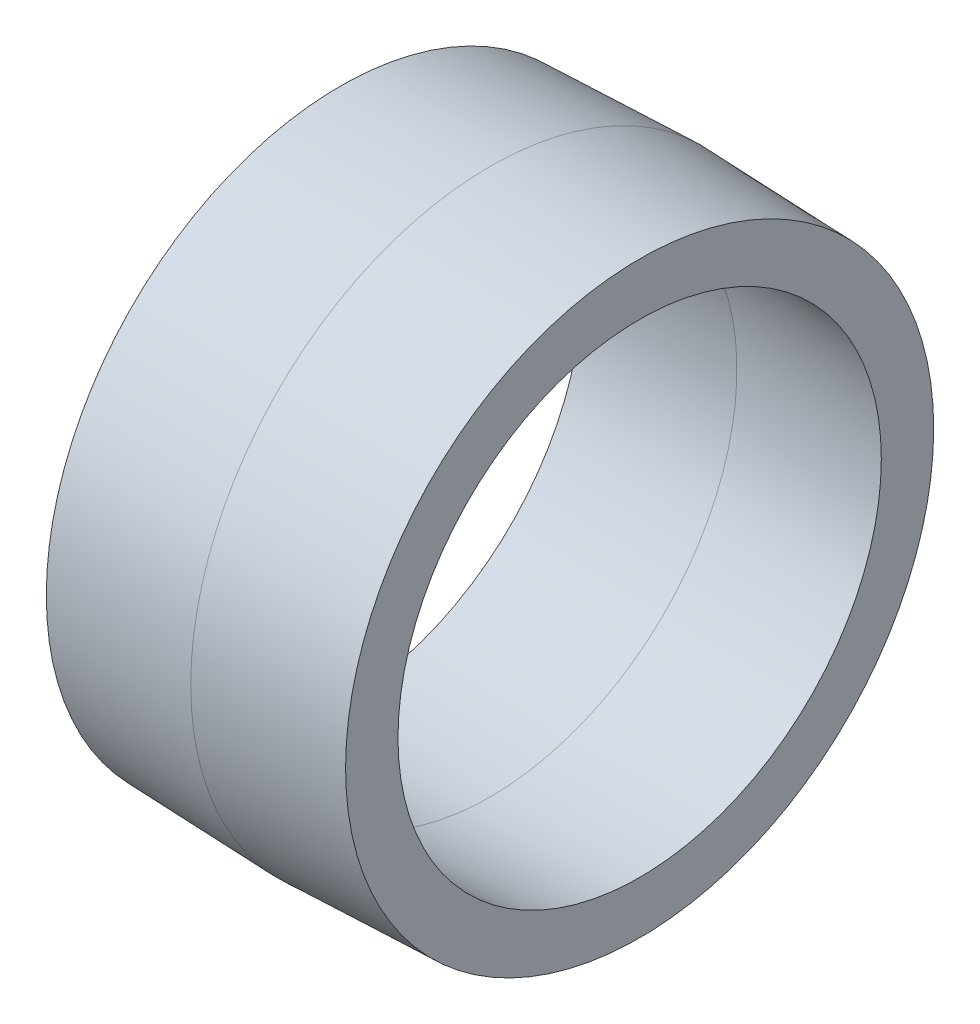
ISO-10303-21;
HEADER;
FILE_DESCRIPTION(('STEP AP214'),'2;1');
FILE_NAME('part.step','',(''),(''),'','','');
FILE_SCHEMA(('AUTOMOTIVE_DESIGN { 1 0 10303 214 1 1 1 1 }'));
ENDSEC;
DATA;
#1=APPLICATION_CONTEXT('core data for automotive mechanical design processes');
#2=APPLICATION_PROTOCOL_DEFINITION('international standard','automotive_design',2000,#1);
#3=PRODUCT_CONTEXT('',#1,'mechanical');
#4=PRODUCT('Part','Part','',(#3));
#5=PRODUCT_RELATED_PRODUCT_CATEGORY('part','',(#4));
#6=PRODUCT_DEFINITION_FORMATION('','',#4);
#7=PRODUCT_DEFINITION_CONTEXT('part definition',#1,'design');
#8=PRODUCT_DEFINITION('design','',#6,#7);
#9=PRODUCT_DEFINITION_SHAPE('','',#8);
#10=(LENGTH_UNIT() NAMED_UNIT(*) SI_UNIT(.MILLI.,.METRE.));
#11=(NAMED_UNIT(*) PLANE_ANGLE_UNIT() SI_UNIT($,.RADIAN.));
#12=(NAMED_UNIT(*) SI_UNIT($,.STERADIAN.) SOLID_ANGLE_UNIT());
#13=UNCERTAINTY_MEASURE_WITH_UNIT(LENGTH_MEASURE(1.E-05),#10,'distance_accuracy_value','');
#14=(GEOMETRIC_REPRESENTATION_CONTEXT(3) GLOBAL_UNCERTAINTY_ASSIGNED_CONTEXT((#13)) GLOBAL_UNIT_ASSIGNED_CONTEXT((#10,
#11,#12)) REPRESENTATION_CONTEXT('',''));
#15=CARTESIAN_POINT('',(0.,0.,0.));
#16=DIRECTION('',(0.,0.,1.));
#17=DIRECTION('',(1.,0.,0.));
#18=AXIS2_PLACEMENT_3D('',#15,#16,#17);
#19=CARTESIAN_POINT('',(12.7,24.9565062274548,0.));
#20=DIRECTION('',(-1.,0.,0.));
#21=DIRECTION('',(0.,0.,1.));
#22=AXIS2_PLACEMENT_3D('',#19,#20,#21);
#23=PLANE('',#22);
#24=CARTESIAN_POINT('',(12.7,0.,0.));
#25=DIRECTION('',(-1.,0.,0.));
#26=DIRECTION('',(0.,0.,1.));
#27=AXIS2_PLACEMENT_3D('',#24,#25,#26);
#28=CIRCLE('',#27,20.5115062274548);
#29=CARTESIAN_POINT('',(12.7,0.,20.5115062274548));
#30=VERTEX_POINT('',#29);
#31=EDGE_CURVE('E33',#30,#30,#28,.T.);
#32=ORIENTED_EDGE('',*,*,#31,.T.);
#33=EDGE_LOOP('',(#32));
#34=FACE_BOUND('',#33,.T.);
#35=CARTESIAN_POINT('',(12.7,0.,0.));
#36=DIRECTION('',(-1.,0.,0.));
#37=DIRECTION('',(0.,0.,1.));
#38=AXIS2_PLACEMENT_3D('',#35,#36,#37);
#39=CIRCLE('',#38,24.9565062274548);
#40=CARTESIAN_POINT('',(12.7,0.,24.9565062274548));
#41=VERTEX_POINT('',#40);
#42=EDGE_CURVE('E39',#41,#41,#39,.T.);
#43=ORIENTED_EDGE('',*,*,#42,.F.);
#44=EDGE_LOOP('',(#43));
#45=FACE_BOUND('',#44,.T.);
#46=ADVANCED_FACE('F14',(#34,#45),#23,.F.);
#47=CARTESIAN_POINT('',(-12.7,24.9565062274548,0.));
#48=DIRECTION('',(1.,0.,0.));
#49=DIRECTION('',(0.,1.,0.));
#50=AXIS2_PLACEMENT_3D('',#47,#48,#49);
#51=PLANE('',#50);
#52=CARTESIAN_POINT('',(-12.7,0.,0.));
#53=DIRECTION('',(-1.,0.,0.));
#54=DIRECTION('',(0.,0.,1.));
#55=AXIS2_PLACEMENT_3D('',#52,#53,#54);
#56=CIRCLE('',#55,20.5115062274548);
#57=CARTESIAN_POINT('',(-12.7,0.,20.5115062274548));
#58=VERTEX_POINT('',#57);
#59=EDGE_CURVE('E9',#58,#58,#56,.T.);
#60=ORIENTED_EDGE('',*,*,#59,.F.);
#61=EDGE_LOOP('',(#60));
#62=FACE_BOUND('',#61,.T.);
#63=CARTESIAN_POINT('',(-12.7,0.,0.));
#64=DIRECTION('',(-1.,0.,0.));
#65=DIRECTION('',(0.,0.,1.));
#66=AXIS2_PLACEMENT_3D('',#63,#64,#65);
#67=CIRCLE('',#66,24.9565062274548);
#68=CARTESIAN_POINT('',(-12.7,0.,24.9565062274548));
#69=VERTEX_POINT('',#68);
#70=EDGE_CURVE('E45',#69,#69,#67,.T.);
#71=ORIENTED_EDGE('',*,*,#70,.T.);
#72=EDGE_LOOP('',(#71));
#73=FACE_BOUND('',#72,.T.);
#74=ADVANCED_FACE('F16',(#62,#73),#51,.F.);
#75=CARTESIAN_POINT('',(-12.7,0.,0.));
#76=DIRECTION('',(1.,0.,0.));
#77=DIRECTION('',(0.,0.,-1.));
#78=AXIS2_PLACEMENT_3D('',#75,#76,#77);
#79=CONICAL_SURFACE('',#78,20.5115062274548,0.0349065850398857);
#80=CARTESIAN_POINT('',(0.,0.,0.));
#81=DIRECTION('',(-1.,0.,0.));
#82=DIRECTION('',(0.,0.,1.));
#83=AXIS2_PLACEMENT_3D('',#80,#81,#82);
#84=CIRCLE('',#83,20.955);
#85=CARTESIAN_POINT('',(0.,0.,20.955));
#86=VERTEX_POINT('',#85);
#87=EDGE_CURVE('E22',#86,#86,#84,.T.);
#88=ORIENTED_EDGE('',*,*,#87,.F.);
#89=EDGE_LOOP('',(#88));
#90=FACE_BOUND('',#89,.T.);
#91=ORIENTED_EDGE('',*,*,#59,.T.);
#92=EDGE_LOOP('',(#91));
#93=FACE_BOUND('',#92,.T.);
#94=ADVANCED_FACE('F62',(#90,#93),#79,.F.);
#95=CARTESIAN_POINT('',(0.,0.,0.));
#96=DIRECTION('',(-1.,0.,0.));
#97=DIRECTION('',(0.,0.,1.));
#98=AXIS2_PLACEMENT_3D('',#95,#96,#97);
#99=CONICAL_SURFACE('',#98,20.955,0.0349065850398857);
#100=ORIENTED_EDGE('',*,*,#87,.T.);
#101=EDGE_LOOP('',(#100));
#102=FACE_BOUND('',#101,.T.);
#103=ORIENTED_EDGE('',*,*,#31,.F.);
#104=EDGE_LOOP('',(#103));
#105=FACE_BOUND('',#104,.T.);
#106=ADVANCED_FACE('F70',(#102,#105),#99,.F.);
#107=CARTESIAN_POINT('',(12.7,0.,0.));
#108=DIRECTION('',(-1.,0.,0.));
#109=DIRECTION('',(0.,0.,1.));
#110=AXIS2_PLACEMENT_3D('',#107,#108,#109);
#111=CONICAL_SURFACE('',#110,24.9565062274548,0.0349065850398857);
#112=CARTESIAN_POINT('',(0.,0.,0.));
#113=DIRECTION('',(-1.,0.,0.));
#114=DIRECTION('',(0.,0.,1.));
#115=AXIS2_PLACEMENT_3D('',#112,#113,#114);
#116=CIRCLE('',#115,25.4);
#117=CARTESIAN_POINT('',(0.,0.,25.4));
#118=VERTEX_POINT('',#117);
#119=EDGE_CURVE('E43',#118,#118,#116,.T.);
#120=ORIENTED_EDGE('',*,*,#119,.F.);
#121=EDGE_LOOP('',(#120));
#122=FACE_BOUND('',#121,.T.);
#123=ORIENTED_EDGE('',*,*,#42,.T.);
#124=EDGE_LOOP('',(#123));
#125=FACE_BOUND('',#124,.T.);
#126=ADVANCED_FACE('F52',(#122,#125),#111,.T.);
#127=CARTESIAN_POINT('',(0.,0.,0.));
#128=DIRECTION('',(1.,0.,0.));
#129=DIRECTION('',(0.,0.,-1.));
#130=AXIS2_PLACEMENT_3D('',#127,#128,#129);
#131=CONICAL_SURFACE('',#130,25.4,0.0349065850398857);
#132=ORIENTED_EDGE('',*,*,#119,.T.);
#133=EDGE_LOOP('',(#132));
#134=FACE_BOUND('',#133,.T.);
#135=ORIENTED_EDGE('',*,*,#70,.F.);
#136=EDGE_LOOP('',(#135));
#137=FACE_BOUND('',#136,.T.);
#138=ADVANCED_FACE('F89',(#134,#137),#131,.T.);
#139=CLOSED_SHELL('',(#46,#74,#94,#106,#126,#138));
#140=MANIFOLD_SOLID_BREP('B1',#139);
#141=ADVANCED_BREP_SHAPE_REPRESENTATION('',(#18,#140),#14);
#142=SHAPE_DEFINITION_REPRESENTATION(#9,#141);
ENDSEC;
END-ISO-10303-21;
